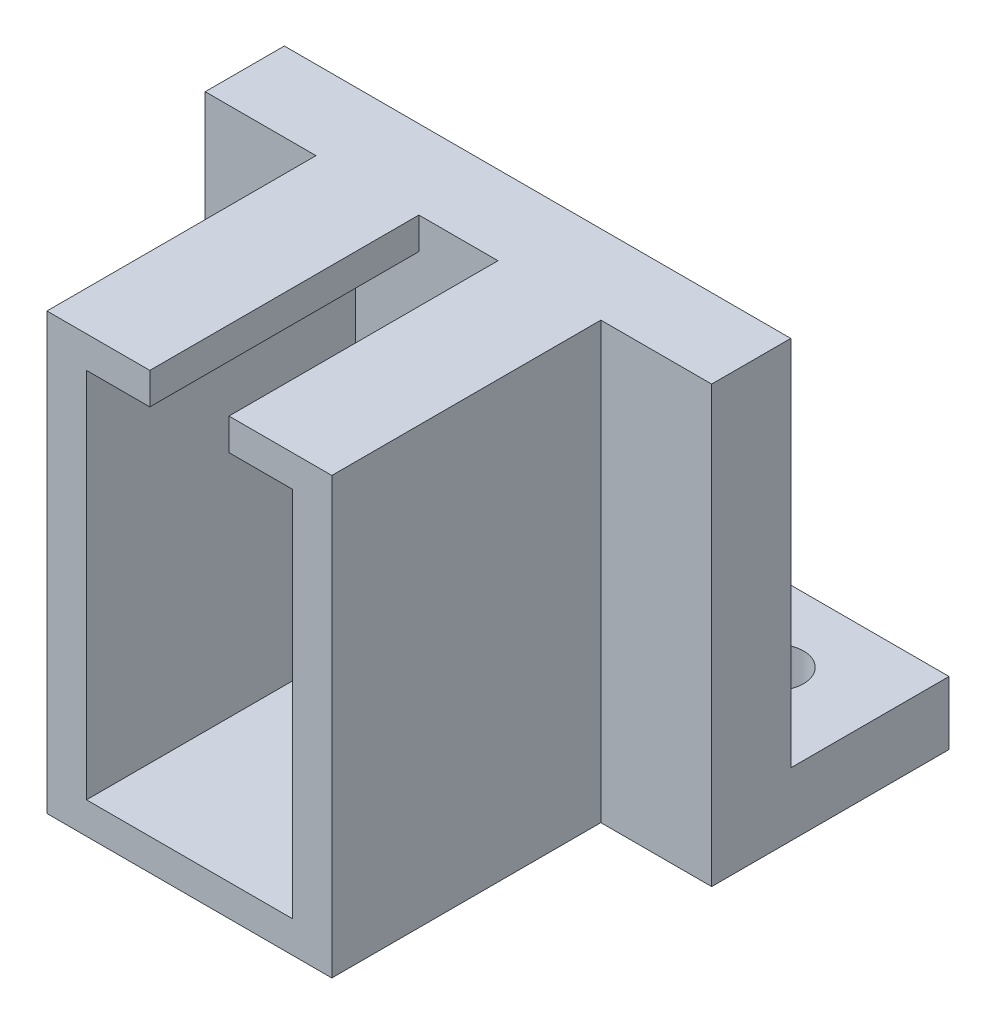
ISO-10303-21;
HEADER;
FILE_DESCRIPTION(('STEP AP214'),'2;1');
FILE_NAME('part.step','',(''),(''),'','','');
FILE_SCHEMA(('AUTOMOTIVE_DESIGN { 1 0 10303 214 1 1 1 1 }'));
ENDSEC;
DATA;
#1=APPLICATION_CONTEXT('core data for automotive mechanical design processes');
#2=APPLICATION_PROTOCOL_DEFINITION('international standard','automotive_design',2000,#1);
#3=PRODUCT_CONTEXT('',#1,'mechanical');
#4=PRODUCT('Part','Part','',(#3));
#5=PRODUCT_RELATED_PRODUCT_CATEGORY('part','',(#4));
#6=PRODUCT_DEFINITION_FORMATION('','',#4);
#7=PRODUCT_DEFINITION_CONTEXT('part definition',#1,'design');
#8=PRODUCT_DEFINITION('design','',#6,#7);
#9=PRODUCT_DEFINITION_SHAPE('','',#8);
#10=(LENGTH_UNIT() NAMED_UNIT(*) SI_UNIT(.MILLI.,.METRE.));
#11=(NAMED_UNIT(*) PLANE_ANGLE_UNIT() SI_UNIT($,.RADIAN.));
#12=(NAMED_UNIT(*) SI_UNIT($,.STERADIAN.) SOLID_ANGLE_UNIT());
#13=UNCERTAINTY_MEASURE_WITH_UNIT(LENGTH_MEASURE(1.E-05),#10,'distance_accuracy_value','');
#14=(GEOMETRIC_REPRESENTATION_CONTEXT(3) GLOBAL_UNCERTAINTY_ASSIGNED_CONTEXT((#13)) GLOBAL_UNIT_ASSIGNED_CONTEXT((#10,
#11,#12)) REPRESENTATION_CONTEXT('',''));
#15=CARTESIAN_POINT('',(0.,0.,0.));
#16=DIRECTION('',(0.,0.,1.));
#17=DIRECTION('',(1.,0.,0.));
#18=AXIS2_PLACEMENT_3D('',#15,#16,#17);
#19=CARTESIAN_POINT('',(0.,4.,5.));
#20=DIRECTION('',(0.,0.,-1.));
#21=DIRECTION('',(-1.,0.,0.));
#22=AXIS2_PLACEMENT_3D('',#19,#20,#21);
#23=PLANE('',#22);
#24=DIRECTION('',(0.,1.,0.));
#25=VECTOR('',#24,1.);
#26=CARTESIAN_POINT('',(9.,0.,5.));
#27=LINE('',#26,#25);
#28=CARTESIAN_POINT('',(9.,0.,5.));
#29=VERTEX_POINT('',#28);
#30=CARTESIAN_POINT('',(9.,27.5,5.));
#31=VERTEX_POINT('',#30);
#32=EDGE_CURVE('E192',#29,#31,#27,.T.);
#33=ORIENTED_EDGE('',*,*,#32,.F.);
#34=DIRECTION('',(1.,0.,0.));
#35=VECTOR('',#34,1.);
#36=CARTESIAN_POINT('',(0.,0.,5.));
#37=LINE('',#36,#35);
#38=CARTESIAN_POINT('',(16.,0.,5.));
#39=VERTEX_POINT('',#38);
#40=EDGE_CURVE('E294',#29,#39,#37,.T.);
#41=ORIENTED_EDGE('',*,*,#40,.T.);
#42=DIRECTION('',(0.,-1.,0.));
#43=VECTOR('',#42,1.);
#44=CARTESIAN_POINT('',(16.,4.,5.));
#45=LINE('',#44,#43);
#46=CARTESIAN_POINT('',(16.,27.5,5.));
#47=VERTEX_POINT('',#46);
#48=EDGE_CURVE('E300',#47,#39,#45,.T.);
#49=ORIENTED_EDGE('',*,*,#48,.F.);
#50=DIRECTION('',(-1.,0.,0.));
#51=VECTOR('',#50,1.);
#52=CARTESIAN_POINT('',(0.,27.5,5.));
#53=LINE('',#52,#51);
#54=EDGE_CURVE('E266',#47,#31,#53,.T.);
#55=ORIENTED_EDGE('',*,*,#54,.T.);
#56=EDGE_LOOP('',(#33,#41,#49,#55));
#57=FACE_BOUND('',#56,.T.);
#58=ADVANCED_FACE('F41',(#57),#23,.F.);
#59=CARTESIAN_POINT('',(-16.,0.,5.));
#60=VERTEX_POINT('',#59);
#61=CARTESIAN_POINT('',(-9.,0.,5.));
#62=VERTEX_POINT('',#61);
#63=EDGE_CURVE('E295',#60,#62,#37,.T.);
#64=ORIENTED_EDGE('',*,*,#63,.T.);
#65=DIRECTION('',(0.,1.,0.));
#66=VECTOR('',#65,1.);
#67=CARTESIAN_POINT('',(-9.,0.,5.));
#68=LINE('',#67,#66);
#69=CARTESIAN_POINT('',(-9.,27.5,5.));
#70=VERTEX_POINT('',#69);
#71=EDGE_CURVE('E195',#62,#70,#68,.T.);
#72=ORIENTED_EDGE('',*,*,#71,.T.);
#73=CARTESIAN_POINT('',(-16.,27.5,5.));
#74=VERTEX_POINT('',#73);
#75=EDGE_CURVE('E265',#70,#74,#53,.T.);
#76=ORIENTED_EDGE('',*,*,#75,.T.);
#77=DIRECTION('',(0.,-1.,0.));
#78=VECTOR('',#77,1.);
#79=CARTESIAN_POINT('',(-16.,4.,5.));
#80=LINE('',#79,#78);
#81=EDGE_CURVE('E50',#74,#60,#80,.T.);
#82=ORIENTED_EDGE('',*,*,#81,.T.);
#83=EDGE_LOOP('',(#64,#72,#76,#82));
#84=FACE_BOUND('',#83,.T.);
#85=ADVANCED_FACE('F307',(#84),#23,.F.);
#86=CARTESIAN_POINT('',(0.,4.,-10.));
#87=DIRECTION('',(0.,0.,1.));
#88=DIRECTION('',(1.,0.,0.));
#89=AXIS2_PLACEMENT_3D('',#86,#87,#88);
#90=PLANE('',#89);
#91=DIRECTION('',(-1.,0.,0.));
#92=VECTOR('',#91,1.);
#93=CARTESIAN_POINT('',(0.,0.,-10.));
#94=LINE('',#93,#92);
#95=CARTESIAN_POINT('',(16.,0.,-10.));
#96=VERTEX_POINT('',#95);
#97=CARTESIAN_POINT('',(-16.,0.,-10.));
#98=VERTEX_POINT('',#97);
#99=EDGE_CURVE('E280',#96,#98,#94,.T.);
#100=ORIENTED_EDGE('',*,*,#99,.T.);
#101=DIRECTION('',(0.,-1.,0.));
#102=VECTOR('',#101,1.);
#103=CARTESIAN_POINT('',(-16.,4.,-10.));
#104=LINE('',#103,#102);
#105=CARTESIAN_POINT('',(-16.,4.,-10.));
#106=VERTEX_POINT('',#105);
#107=EDGE_CURVE('E11',#106,#98,#104,.T.);
#108=ORIENTED_EDGE('',*,*,#107,.F.);
#109=DIRECTION('',(-1.,0.,0.));
#110=VECTOR('',#109,1.);
#111=CARTESIAN_POINT('',(0.,4.,-10.));
#112=LINE('',#111,#110);
#113=CARTESIAN_POINT('',(16.,4.,-10.));
#114=VERTEX_POINT('',#113);
#115=EDGE_CURVE('E281',#114,#106,#112,.T.);
#116=ORIENTED_EDGE('',*,*,#115,.F.);
#117=DIRECTION('',(0.,-1.,0.));
#118=VECTOR('',#117,1.);
#119=CARTESIAN_POINT('',(16.,4.,-10.));
#120=LINE('',#119,#118);
#121=EDGE_CURVE('E289',#114,#96,#120,.T.);
#122=ORIENTED_EDGE('',*,*,#121,.T.);
#123=EDGE_LOOP('',(#100,#108,#116,#122));
#124=FACE_BOUND('',#123,.T.);
#125=ADVANCED_FACE('F43',(#124),#90,.F.);
#126=CARTESIAN_POINT('',(-16.,4.,0.));
#127=DIRECTION('',(1.,0.,0.));
#128=DIRECTION('',(0.,0.,-1.));
#129=AXIS2_PLACEMENT_3D('',#126,#127,#128);
#130=PLANE('',#129);
#131=DIRECTION('',(0.,0.,1.));
#132=VECTOR('',#131,1.);
#133=CARTESIAN_POINT('',(-16.,0.,0.));
#134=LINE('',#133,#132);
#135=EDGE_CURVE('E292',#98,#60,#134,.T.);
#136=ORIENTED_EDGE('',*,*,#135,.T.);
#137=ORIENTED_EDGE('',*,*,#81,.F.);
#138=DIRECTION('',(0.,0.,-1.));
#139=VECTOR('',#138,1.);
#140=CARTESIAN_POINT('',(-16.,27.5,0.));
#141=LINE('',#140,#139);
#142=CARTESIAN_POINT('',(-16.,27.5,0.));
#143=VERTEX_POINT('',#142);
#144=EDGE_CURVE('E262',#74,#143,#141,.T.);
#145=ORIENTED_EDGE('',*,*,#144,.T.);
#146=DIRECTION('',(0.,-1.,0.));
#147=VECTOR('',#146,1.);
#148=CARTESIAN_POINT('',(-16.,27.5,0.));
#149=LINE('',#148,#147);
#150=CARTESIAN_POINT('',(-16.,4.,0.));
#151=VERTEX_POINT('',#150);
#152=EDGE_CURVE('E277',#143,#151,#149,.T.);
#153=ORIENTED_EDGE('',*,*,#152,.T.);
#154=DIRECTION('',(0.,0.,1.));
#155=VECTOR('',#154,1.);
#156=CARTESIAN_POINT('',(-16.,4.,0.));
#157=LINE('',#156,#155);
#158=EDGE_CURVE('E284',#106,#151,#157,.T.);
#159=ORIENTED_EDGE('',*,*,#158,.F.);
#160=ORIENTED_EDGE('',*,*,#107,.T.);
#161=EDGE_LOOP('',(#136,#137,#145,#153,#159,#160));
#162=FACE_BOUND('',#161,.T.);
#163=ADVANCED_FACE('F361',(#162),#130,.F.);
#164=DIRECTION('',(1.,0.,0.));
#165=VECTOR('',#164,1.);
#166=CARTESIAN_POINT('',(0.,25.5,5.));
#167=LINE('',#166,#165);
#168=CARTESIAN_POINT('',(2.5,25.5,5.));
#169=VERTEX_POINT('',#168);
#170=CARTESIAN_POINT('',(6.5,25.5,5.));
#171=VERTEX_POINT('',#170);
#172=EDGE_CURVE('E221',#169,#171,#167,.T.);
#173=ORIENTED_EDGE('',*,*,#172,.F.);
#174=DIRECTION('',(0.,1.,0.));
#175=VECTOR('',#174,1.);
#176=CARTESIAN_POINT('',(2.49999999999999,0.,5.));
#177=LINE('',#176,#175);
#178=CARTESIAN_POINT('',(2.5,27.5,5.));
#179=VERTEX_POINT('',#178);
#180=EDGE_CURVE('E173',#169,#179,#177,.T.);
#181=ORIENTED_EDGE('',*,*,#180,.T.);
#182=CARTESIAN_POINT('',(-2.5,27.5,5.));
#183=VERTEX_POINT('',#182);
#184=EDGE_CURVE('E269',#179,#183,#53,.T.);
#185=ORIENTED_EDGE('',*,*,#184,.T.);
#186=DIRECTION('',(0.,-1.,0.));
#187=VECTOR('',#186,1.);
#188=CARTESIAN_POINT('',(-2.49999999999999,0.,5.));
#189=LINE('',#188,#187);
#190=CARTESIAN_POINT('',(-2.5,25.5,5.));
#191=VERTEX_POINT('',#190);
#192=EDGE_CURVE('E57',#183,#191,#189,.T.);
#193=ORIENTED_EDGE('',*,*,#192,.T.);
#194=CARTESIAN_POINT('',(-6.5,25.5,5.));
#195=VERTEX_POINT('',#194);
#196=EDGE_CURVE('E62',#195,#191,#167,.T.);
#197=ORIENTED_EDGE('',*,*,#196,.F.);
#198=DIRECTION('',(0.,-1.,0.));
#199=VECTOR('',#198,1.);
#200=CARTESIAN_POINT('',(-6.5,0.,5.));
#201=LINE('',#200,#199);
#202=CARTESIAN_POINT('',(-6.5,2.,5.));
#203=VERTEX_POINT('',#202);
#204=EDGE_CURVE('E228',#195,#203,#201,.T.);
#205=ORIENTED_EDGE('',*,*,#204,.T.);
#206=DIRECTION('',(1.,0.,0.));
#207=VECTOR('',#206,1.);
#208=CARTESIAN_POINT('',(0.,2.,5.));
#209=LINE('',#208,#207);
#210=CARTESIAN_POINT('',(6.5,2.,5.));
#211=VERTEX_POINT('',#210);
#212=EDGE_CURVE('E226',#203,#211,#209,.T.);
#213=ORIENTED_EDGE('',*,*,#212,.T.);
#214=DIRECTION('',(0.,-1.,0.));
#215=VECTOR('',#214,1.);
#216=CARTESIAN_POINT('',(6.5,0.,5.));
#217=LINE('',#216,#215);
#218=EDGE_CURVE('E223',#171,#211,#217,.T.);
#219=ORIENTED_EDGE('',*,*,#218,.F.);
#220=EDGE_LOOP('',(#173,#181,#185,#193,#197,#205,#213,#219));
#221=FACE_BOUND('',#220,.T.);
#222=ADVANCED_FACE('F325',(#221),#23,.F.);
#223=CARTESIAN_POINT('',(16.,4.,0.));
#224=DIRECTION('',(-1.,0.,0.));
#225=DIRECTION('',(0.,0.,1.));
#226=AXIS2_PLACEMENT_3D('',#223,#224,#225);
#227=PLANE('',#226);
#228=DIRECTION('',(0.,0.,-1.));
#229=VECTOR('',#228,1.);
#230=CARTESIAN_POINT('',(16.,0.,0.));
#231=LINE('',#230,#229);
#232=EDGE_CURVE('E285',#39,#96,#231,.T.);
#233=ORIENTED_EDGE('',*,*,#232,.T.);
#234=ORIENTED_EDGE('',*,*,#121,.F.);
#235=DIRECTION('',(0.,0.,-1.));
#236=VECTOR('',#235,1.);
#237=CARTESIAN_POINT('',(16.,4.,0.));
#238=LINE('',#237,#236);
#239=CARTESIAN_POINT('',(16.,4.,0.));
#240=VERTEX_POINT('',#239);
#241=EDGE_CURVE('E287',#240,#114,#238,.T.);
#242=ORIENTED_EDGE('',*,*,#241,.F.);
#243=DIRECTION('',(0.,-1.,0.));
#244=VECTOR('',#243,1.);
#245=CARTESIAN_POINT('',(16.,27.5,0.));
#246=LINE('',#245,#244);
#247=CARTESIAN_POINT('',(16.,27.5,0.));
#248=VERTEX_POINT('',#247);
#249=EDGE_CURVE('E272',#248,#240,#246,.T.);
#250=ORIENTED_EDGE('',*,*,#249,.F.);
#251=DIRECTION('',(0.,0.,1.));
#252=VECTOR('',#251,1.);
#253=CARTESIAN_POINT('',(16.,27.5,0.));
#254=LINE('',#253,#252);
#255=EDGE_CURVE('E268',#248,#47,#254,.T.);
#256=ORIENTED_EDGE('',*,*,#255,.T.);
#257=ORIENTED_EDGE('',*,*,#48,.T.);
#258=EDGE_LOOP('',(#233,#234,#242,#250,#256,#257));
#259=FACE_BOUND('',#258,.T.);
#260=ADVANCED_FACE('F354',(#259),#227,.F.);
#261=CARTESIAN_POINT('',(0.,4.,0.));
#262=DIRECTION('',(0.,1.,0.));
#263=DIRECTION('',(0.,0.,1.));
#264=AXIS2_PLACEMENT_3D('',#261,#262,#263);
#265=PLANE('',#264);
#266=CARTESIAN_POINT('',(-10.,4.,-5.));
#267=DIRECTION('',(0.,1.,0.));
#268=DIRECTION('',(0.,0.,1.));
#269=AXIS2_PLACEMENT_3D('',#266,#267,#268);
#270=CIRCLE('',#269,1.8);
#271=CARTESIAN_POINT('',(-10.,4.,-3.2));
#272=VERTEX_POINT('',#271);
#273=EDGE_CURVE('E417',#272,#272,#270,.T.);
#274=ORIENTED_EDGE('',*,*,#273,.F.);
#275=EDGE_LOOP('',(#274));
#276=FACE_BOUND('',#275,.T.);
#277=CARTESIAN_POINT('',(10.,4.,-5.));
#278=DIRECTION('',(0.,1.,0.));
#279=DIRECTION('',(0.,0.,1.));
#280=AXIS2_PLACEMENT_3D('',#277,#278,#279);
#281=CIRCLE('',#280,1.8);
#282=CARTESIAN_POINT('',(10.,4.,-3.2));
#283=VERTEX_POINT('',#282);
#284=EDGE_CURVE('E198',#283,#283,#281,.T.);
#285=ORIENTED_EDGE('',*,*,#284,.F.);
#286=EDGE_LOOP('',(#285));
#287=FACE_BOUND('',#286,.T.);
#288=DIRECTION('',(-1.,0.,0.));
#289=VECTOR('',#288,1.);
#290=CARTESIAN_POINT('',(0.,4.,0.));
#291=LINE('',#290,#289);
#292=EDGE_CURVE('E176',#240,#151,#291,.T.);
#293=ORIENTED_EDGE('',*,*,#292,.F.);
#294=ORIENTED_EDGE('',*,*,#241,.T.);
#295=ORIENTED_EDGE('',*,*,#115,.T.);
#296=ORIENTED_EDGE('',*,*,#158,.T.);
#297=EDGE_LOOP('',(#293,#294,#295,#296));
#298=FACE_BOUND('',#297,.T.);
#299=ADVANCED_FACE('F376',(#276,#287,#298),#265,.T.);
#300=CARTESIAN_POINT('',(0.,0.,0.));
#301=DIRECTION('',(0.,1.,0.));
#302=DIRECTION('',(0.,0.,1.));
#303=AXIS2_PLACEMENT_3D('',#300,#301,#302);
#304=PLANE('',#303);
#305=CARTESIAN_POINT('',(-10.,0.,-5.));
#306=DIRECTION('',(0.,1.,0.));
#307=DIRECTION('',(0.,0.,1.));
#308=AXIS2_PLACEMENT_3D('',#305,#306,#307);
#309=CIRCLE('',#308,1.8);
#310=CARTESIAN_POINT('',(-10.,0.,-3.2));
#311=VERTEX_POINT('',#310);
#312=EDGE_CURVE('E420',#311,#311,#309,.T.);
#313=ORIENTED_EDGE('',*,*,#312,.T.);
#314=EDGE_LOOP('',(#313));
#315=FACE_BOUND('',#314,.T.);
#316=CARTESIAN_POINT('',(10.,0.,-5.));
#317=DIRECTION('',(0.,1.,0.));
#318=DIRECTION('',(0.,0.,1.));
#319=AXIS2_PLACEMENT_3D('',#316,#317,#318);
#320=CIRCLE('',#319,1.8);
#321=CARTESIAN_POINT('',(10.,0.,-3.2));
#322=VERTEX_POINT('',#321);
#323=EDGE_CURVE('E45',#322,#322,#320,.T.);
#324=ORIENTED_EDGE('',*,*,#323,.T.);
#325=EDGE_LOOP('',(#324));
#326=FACE_BOUND('',#325,.T.);
#327=ORIENTED_EDGE('',*,*,#99,.F.);
#328=ORIENTED_EDGE('',*,*,#232,.F.);
#329=ORIENTED_EDGE('',*,*,#40,.F.);
#330=DIRECTION('',(0.,0.,-1.));
#331=VECTOR('',#330,1.);
#332=CARTESIAN_POINT('',(9.,0.,22.));
#333=LINE('',#332,#331);
#334=CARTESIAN_POINT('',(9.,0.,22.));
#335=VERTEX_POINT('',#334);
#336=EDGE_CURVE('E237',#335,#29,#333,.T.);
#337=ORIENTED_EDGE('',*,*,#336,.F.);
#338=DIRECTION('',(1.,0.,0.));
#339=VECTOR('',#338,1.);
#340=CARTESIAN_POINT('',(0.,0.,22.));
#341=LINE('',#340,#339);
#342=CARTESIAN_POINT('',(-9.,0.,22.));
#343=VERTEX_POINT('',#342);
#344=EDGE_CURVE('E216',#343,#335,#341,.T.);
#345=ORIENTED_EDGE('',*,*,#344,.F.);
#346=DIRECTION('',(0.,0.,-1.));
#347=VECTOR('',#346,1.);
#348=CARTESIAN_POINT('',(-9.,0.,22.));
#349=LINE('',#348,#347);
#350=EDGE_CURVE('E240',#343,#62,#349,.T.);
#351=ORIENTED_EDGE('',*,*,#350,.T.);
#352=ORIENTED_EDGE('',*,*,#63,.F.);
#353=ORIENTED_EDGE('',*,*,#135,.F.);
#354=EDGE_LOOP('',(#327,#328,#329,#337,#345,#351,#352,#353));
#355=FACE_BOUND('',#354,.T.);
#356=ADVANCED_FACE('F313',(#315,#326,#355),#304,.F.);
#357=CARTESIAN_POINT('',(0.,27.5,0.));
#358=DIRECTION('',(0.,0.,1.));
#359=DIRECTION('',(1.,0.,0.));
#360=AXIS2_PLACEMENT_3D('',#357,#358,#359);
#361=PLANE('',#360);
#362=ORIENTED_EDGE('',*,*,#292,.T.);
#363=ORIENTED_EDGE('',*,*,#152,.F.);
#364=DIRECTION('',(-1.,0.,0.));
#365=VECTOR('',#364,1.);
#366=CARTESIAN_POINT('',(0.,27.5,0.));
#367=LINE('',#366,#365);
#368=EDGE_CURVE('E260',#248,#143,#367,.T.);
#369=ORIENTED_EDGE('',*,*,#368,.F.);
#370=ORIENTED_EDGE('',*,*,#249,.T.);
#371=EDGE_LOOP('',(#362,#363,#369,#370));
#372=FACE_BOUND('',#371,.T.);
#373=ADVANCED_FACE('F360',(#372),#361,.F.);
#374=CARTESIAN_POINT('',(0.,27.5,0.));
#375=DIRECTION('',(0.,-1.,0.));
#376=DIRECTION('',(0.,0.,-1.));
#377=AXIS2_PLACEMENT_3D('',#374,#375,#376);
#378=PLANE('',#377);
#379=ORIENTED_EDGE('',*,*,#368,.T.);
#380=ORIENTED_EDGE('',*,*,#144,.F.);
#381=ORIENTED_EDGE('',*,*,#75,.F.);
#382=DIRECTION('',(0.,0.,-1.));
#383=VECTOR('',#382,1.);
#384=CARTESIAN_POINT('',(-9.,27.5,22.));
#385=LINE('',#384,#383);
#386=CARTESIAN_POINT('',(-9.,27.5,22.));
#387=VERTEX_POINT('',#386);
#388=EDGE_CURVE('E243',#387,#70,#385,.T.);
#389=ORIENTED_EDGE('',*,*,#388,.F.);
#390=DIRECTION('',(-1.,0.,0.));
#391=VECTOR('',#390,1.);
#392=CARTESIAN_POINT('',(0.,27.5,22.));
#393=LINE('',#392,#391);
#394=CARTESIAN_POINT('',(-2.5,27.5,22.));
#395=VERTEX_POINT('',#394);
#396=EDGE_CURVE('E211',#395,#387,#393,.T.);
#397=ORIENTED_EDGE('',*,*,#396,.F.);
#398=DIRECTION('',(0.,0.,-1.));
#399=VECTOR('',#398,1.);
#400=CARTESIAN_POINT('',(-2.5,27.5,22.));
#401=LINE('',#400,#399);
#402=EDGE_CURVE('E246',#395,#183,#401,.T.);
#403=ORIENTED_EDGE('',*,*,#402,.T.);
#404=ORIENTED_EDGE('',*,*,#184,.F.);
#405=DIRECTION('',(0.,0.,-1.));
#406=VECTOR('',#405,1.);
#407=CARTESIAN_POINT('',(2.5,27.5,22.));
#408=LINE('',#407,#406);
#409=CARTESIAN_POINT('',(2.5,27.5,22.));
#410=VERTEX_POINT('',#409);
#411=EDGE_CURVE('E232',#410,#179,#408,.T.);
#412=ORIENTED_EDGE('',*,*,#411,.F.);
#413=CARTESIAN_POINT('',(9.,27.5,22.));
#414=VERTEX_POINT('',#413);
#415=EDGE_CURVE('E190',#414,#410,#393,.T.);
#416=ORIENTED_EDGE('',*,*,#415,.F.);
#417=DIRECTION('',(0.,0.,-1.));
#418=VECTOR('',#417,1.);
#419=CARTESIAN_POINT('',(9.,27.5,22.));
#420=LINE('',#419,#418);
#421=EDGE_CURVE('E234',#414,#31,#420,.T.);
#422=ORIENTED_EDGE('',*,*,#421,.T.);
#423=ORIENTED_EDGE('',*,*,#54,.F.);
#424=ORIENTED_EDGE('',*,*,#255,.F.);
#425=EDGE_LOOP('',(#379,#380,#381,#389,#397,#403,#404,#412,#416,#422,#423,#424));
#426=FACE_BOUND('',#425,.T.);
#427=ADVANCED_FACE('F322',(#426),#378,.F.);
#428=CARTESIAN_POINT('',(2.49999999999999,0.,22.));
#429=DIRECTION('',(-1.,0.,0.));
#430=DIRECTION('',(0.,-1.,0.));
#431=AXIS2_PLACEMENT_3D('',#428,#429,#430);
#432=PLANE('',#431);
#433=ORIENTED_EDGE('',*,*,#180,.F.);
#434=DIRECTION('',(0.,0.,-1.));
#435=VECTOR('',#434,1.);
#436=CARTESIAN_POINT('',(2.5,25.5,22.));
#437=LINE('',#436,#435);
#438=CARTESIAN_POINT('',(2.5,25.5,22.));
#439=VERTEX_POINT('',#438);
#440=EDGE_CURVE('E167',#439,#169,#437,.T.);
#441=ORIENTED_EDGE('',*,*,#440,.F.);
#442=DIRECTION('',(0.,1.,0.));
#443=VECTOR('',#442,1.);
#444=CARTESIAN_POINT('',(2.49999999999999,0.,22.));
#445=LINE('',#444,#443);
#446=EDGE_CURVE('E172',#439,#410,#445,.T.);
#447=ORIENTED_EDGE('',*,*,#446,.T.);
#448=ORIENTED_EDGE('',*,*,#411,.T.);
#449=EDGE_LOOP('',(#433,#441,#447,#448));
#450=FACE_BOUND('',#449,.T.);
#451=ADVANCED_FACE('F169',(#450),#432,.T.);
#452=CARTESIAN_POINT('',(0.,25.5,22.));
#453=DIRECTION('',(0.,1.,0.));
#454=DIRECTION('',(0.,0.,1.));
#455=AXIS2_PLACEMENT_3D('',#452,#453,#454);
#456=PLANE('',#455);
#457=ORIENTED_EDGE('',*,*,#172,.T.);
#458=DIRECTION('',(0.,0.,-1.));
#459=VECTOR('',#458,1.);
#460=CARTESIAN_POINT('',(6.5,25.5,22.));
#461=LINE('',#460,#459);
#462=CARTESIAN_POINT('',(6.5,25.5,22.));
#463=VERTEX_POINT('',#462);
#464=EDGE_CURVE('E177',#463,#171,#461,.T.);
#465=ORIENTED_EDGE('',*,*,#464,.F.);
#466=DIRECTION('',(1.,0.,0.));
#467=VECTOR('',#466,1.);
#468=CARTESIAN_POINT('',(0.,25.5,22.));
#469=LINE('',#468,#467);
#470=EDGE_CURVE('E180',#439,#463,#469,.T.);
#471=ORIENTED_EDGE('',*,*,#470,.F.);
#472=ORIENTED_EDGE('',*,*,#440,.T.);
#473=EDGE_LOOP('',(#457,#465,#471,#472));
#474=FACE_BOUND('',#473,.T.);
#475=ADVANCED_FACE('F181',(#474),#456,.F.);
#476=CARTESIAN_POINT('',(6.5,0.,22.));
#477=DIRECTION('',(1.,0.,0.));
#478=DIRECTION('',(0.,1.,0.));
#479=AXIS2_PLACEMENT_3D('',#476,#477,#478);
#480=PLANE('',#479);
#481=ORIENTED_EDGE('',*,*,#218,.T.);
#482=DIRECTION('',(0.,0.,-1.));
#483=VECTOR('',#482,1.);
#484=CARTESIAN_POINT('',(6.5,2.,22.));
#485=LINE('',#484,#483);
#486=CARTESIAN_POINT('',(6.5,2.,22.));
#487=VERTEX_POINT('',#486);
#488=EDGE_CURVE('E256',#487,#211,#485,.T.);
#489=ORIENTED_EDGE('',*,*,#488,.F.);
#490=DIRECTION('',(0.,-1.,0.));
#491=VECTOR('',#490,1.);
#492=CARTESIAN_POINT('',(6.5,0.,22.));
#493=LINE('',#492,#491);
#494=EDGE_CURVE('E185',#463,#487,#493,.T.);
#495=ORIENTED_EDGE('',*,*,#494,.F.);
#496=ORIENTED_EDGE('',*,*,#464,.T.);
#497=EDGE_LOOP('',(#481,#489,#495,#496));
#498=FACE_BOUND('',#497,.T.);
#499=ADVANCED_FACE('F343',(#498),#480,.F.);
#500=CARTESIAN_POINT('',(0.,2.,22.));
#501=DIRECTION('',(0.,1.,0.));
#502=DIRECTION('',(0.,0.,1.));
#503=AXIS2_PLACEMENT_3D('',#500,#501,#502);
#504=PLANE('',#503);
#505=ORIENTED_EDGE('',*,*,#212,.F.);
#506=DIRECTION('',(0.,0.,-1.));
#507=VECTOR('',#506,1.);
#508=CARTESIAN_POINT('',(-6.5,2.,22.));
#509=LINE('',#508,#507);
#510=CARTESIAN_POINT('',(-6.5,2.,22.));
#511=VERTEX_POINT('',#510);
#512=EDGE_CURVE('E253',#511,#203,#509,.T.);
#513=ORIENTED_EDGE('',*,*,#512,.F.);
#514=DIRECTION('',(1.,0.,0.));
#515=VECTOR('',#514,1.);
#516=CARTESIAN_POINT('',(0.,2.,22.));
#517=LINE('',#516,#515);
#518=EDGE_CURVE('E202',#511,#487,#517,.T.);
#519=ORIENTED_EDGE('',*,*,#518,.T.);
#520=ORIENTED_EDGE('',*,*,#488,.T.);
#521=EDGE_LOOP('',(#505,#513,#519,#520));
#522=FACE_BOUND('',#521,.T.);
#523=ADVANCED_FACE('F340',(#522),#504,.T.);
#524=CARTESIAN_POINT('',(-6.5,0.,22.));
#525=DIRECTION('',(1.,0.,0.));
#526=DIRECTION('',(0.,1.,0.));
#527=AXIS2_PLACEMENT_3D('',#524,#525,#526);
#528=PLANE('',#527);
#529=ORIENTED_EDGE('',*,*,#204,.F.);
#530=DIRECTION('',(0.,0.,-1.));
#531=VECTOR('',#530,1.);
#532=CARTESIAN_POINT('',(-6.5,25.5,22.));
#533=LINE('',#532,#531);
#534=CARTESIAN_POINT('',(-6.5,25.5,22.));
#535=VERTEX_POINT('',#534);
#536=EDGE_CURVE('E251',#535,#195,#533,.T.);
#537=ORIENTED_EDGE('',*,*,#536,.F.);
#538=DIRECTION('',(0.,-1.,0.));
#539=VECTOR('',#538,1.);
#540=CARTESIAN_POINT('',(-6.5,0.,22.));
#541=LINE('',#540,#539);
#542=EDGE_CURVE('E205',#535,#511,#541,.T.);
#543=ORIENTED_EDGE('',*,*,#542,.T.);
#544=ORIENTED_EDGE('',*,*,#512,.T.);
#545=EDGE_LOOP('',(#529,#537,#543,#544));
#546=FACE_BOUND('',#545,.T.);
#547=ADVANCED_FACE('F336',(#546),#528,.T.);
#548=ORIENTED_EDGE('',*,*,#196,.T.);
#549=DIRECTION('',(0.,0.,-1.));
#550=VECTOR('',#549,1.);
#551=CARTESIAN_POINT('',(-2.5,25.5,22.));
#552=LINE('',#551,#550);
#553=CARTESIAN_POINT('',(-2.5,25.5,22.));
#554=VERTEX_POINT('',#553);
#555=EDGE_CURVE('E249',#554,#191,#552,.T.);
#556=ORIENTED_EDGE('',*,*,#555,.F.);
#557=EDGE_CURVE('E187',#535,#554,#469,.T.);
#558=ORIENTED_EDGE('',*,*,#557,.F.);
#559=ORIENTED_EDGE('',*,*,#536,.T.);
#560=EDGE_LOOP('',(#548,#556,#558,#559));
#561=FACE_BOUND('',#560,.T.);
#562=ADVANCED_FACE('F332',(#561),#456,.F.);
#563=CARTESIAN_POINT('',(-2.49999999999999,0.,22.));
#564=DIRECTION('',(1.,0.,0.));
#565=DIRECTION('',(0.,1.,0.));
#566=AXIS2_PLACEMENT_3D('',#563,#564,#565);
#567=PLANE('',#566);
#568=ORIENTED_EDGE('',*,*,#192,.F.);
#569=ORIENTED_EDGE('',*,*,#402,.F.);
#570=DIRECTION('',(0.,-1.,0.));
#571=VECTOR('',#570,1.);
#572=CARTESIAN_POINT('',(-2.49999999999999,0.,22.));
#573=LINE('',#572,#571);
#574=EDGE_CURVE('E208',#395,#554,#573,.T.);
#575=ORIENTED_EDGE('',*,*,#574,.T.);
#576=ORIENTED_EDGE('',*,*,#555,.T.);
#577=EDGE_LOOP('',(#568,#569,#575,#576));
#578=FACE_BOUND('',#577,.T.);
#579=ADVANCED_FACE('F328',(#578),#567,.T.);
#580=CARTESIAN_POINT('',(-9.,0.,22.));
#581=DIRECTION('',(-1.,0.,0.));
#582=DIRECTION('',(0.,-1.,0.));
#583=AXIS2_PLACEMENT_3D('',#580,#581,#582);
#584=PLANE('',#583);
#585=ORIENTED_EDGE('',*,*,#71,.F.);
#586=ORIENTED_EDGE('',*,*,#350,.F.);
#587=DIRECTION('',(0.,1.,0.));
#588=VECTOR('',#587,1.);
#589=CARTESIAN_POINT('',(-9.,0.,22.));
#590=LINE('',#589,#588);
#591=EDGE_CURVE('E213',#343,#387,#590,.T.);
#592=ORIENTED_EDGE('',*,*,#591,.T.);
#593=ORIENTED_EDGE('',*,*,#388,.T.);
#594=EDGE_LOOP('',(#585,#586,#592,#593));
#595=FACE_BOUND('',#594,.T.);
#596=ADVANCED_FACE('F319',(#595),#584,.T.);
#597=CARTESIAN_POINT('',(9.,0.,22.));
#598=DIRECTION('',(-1.,0.,0.));
#599=DIRECTION('',(0.,-1.,0.));
#600=AXIS2_PLACEMENT_3D('',#597,#598,#599);
#601=PLANE('',#600);
#602=ORIENTED_EDGE('',*,*,#32,.T.);
#603=ORIENTED_EDGE('',*,*,#421,.F.);
#604=DIRECTION('',(0.,1.,0.));
#605=VECTOR('',#604,1.);
#606=CARTESIAN_POINT('',(9.,0.,22.));
#607=LINE('',#606,#605);
#608=EDGE_CURVE('E218',#335,#414,#607,.T.);
#609=ORIENTED_EDGE('',*,*,#608,.F.);
#610=ORIENTED_EDGE('',*,*,#336,.T.);
#611=EDGE_LOOP('',(#602,#603,#609,#610));
#612=FACE_BOUND('',#611,.T.);
#613=ADVANCED_FACE('F349',(#612),#601,.F.);
#614=CARTESIAN_POINT('',(0.,0.,22.));
#615=DIRECTION('',(0.,0.,1.));
#616=DIRECTION('',(1.,0.,0.));
#617=AXIS2_PLACEMENT_3D('',#614,#615,#616);
#618=PLANE('',#617);
#619=ORIENTED_EDGE('',*,*,#446,.F.);
#620=ORIENTED_EDGE('',*,*,#470,.T.);
#621=ORIENTED_EDGE('',*,*,#494,.T.);
#622=ORIENTED_EDGE('',*,*,#518,.F.);
#623=ORIENTED_EDGE('',*,*,#542,.F.);
#624=ORIENTED_EDGE('',*,*,#557,.T.);
#625=ORIENTED_EDGE('',*,*,#574,.F.);
#626=ORIENTED_EDGE('',*,*,#396,.T.);
#627=ORIENTED_EDGE('',*,*,#591,.F.);
#628=ORIENTED_EDGE('',*,*,#344,.T.);
#629=ORIENTED_EDGE('',*,*,#608,.T.);
#630=ORIENTED_EDGE('',*,*,#415,.T.);
#631=EDGE_LOOP('',(#619,#620,#621,#622,#623,#624,#625,#626,#627,#628,#629,#630));
#632=FACE_BOUND('',#631,.T.);
#633=ADVANCED_FACE('F188',(#632),#618,.T.);
#634=CARTESIAN_POINT('',(10.,4.,-5.));
#635=DIRECTION('',(0.,1.,0.));
#636=DIRECTION('',(0.,0.,1.));
#637=AXIS2_PLACEMENT_3D('',#634,#635,#636);
#638=CYLINDRICAL_SURFACE('',#637,1.8);
#639=ORIENTED_EDGE('',*,*,#284,.T.);
#640=EDGE_LOOP('',(#639));
#641=FACE_BOUND('',#640,.T.);
#642=ORIENTED_EDGE('',*,*,#323,.F.);
#643=EDGE_LOOP('',(#642));
#644=FACE_BOUND('',#643,.T.);
#645=ADVANCED_FACE('F405',(#641,#644),#638,.F.);
#646=CARTESIAN_POINT('',(-10.,4.,-5.));
#647=DIRECTION('',(0.,1.,0.));
#648=DIRECTION('',(0.,0.,1.));
#649=AXIS2_PLACEMENT_3D('',#646,#647,#648);
#650=CYLINDRICAL_SURFACE('',#649,1.8);
#651=ORIENTED_EDGE('',*,*,#273,.T.);
#652=EDGE_LOOP('',(#651));
#653=FACE_BOUND('',#652,.T.);
#654=ORIENTED_EDGE('',*,*,#312,.F.);
#655=EDGE_LOOP('',(#654));
#656=FACE_BOUND('',#655,.T.);
#657=ADVANCED_FACE('F408',(#653,#656),#650,.F.);
#658=CLOSED_SHELL('',(#58,#85,#125,#163,#222,#260,#299,#356,#373,#427,#451,#475,#499,#523,#547,
#562,#579,#596,#613,#633,#645,#657));
#659=MANIFOLD_SOLID_BREP('B2',#658);
#660=ADVANCED_BREP_SHAPE_REPRESENTATION('',(#18,#659),#14);
#661=SHAPE_DEFINITION_REPRESENTATION(#9,#660);
ENDSEC;
END-ISO-10303-21;
